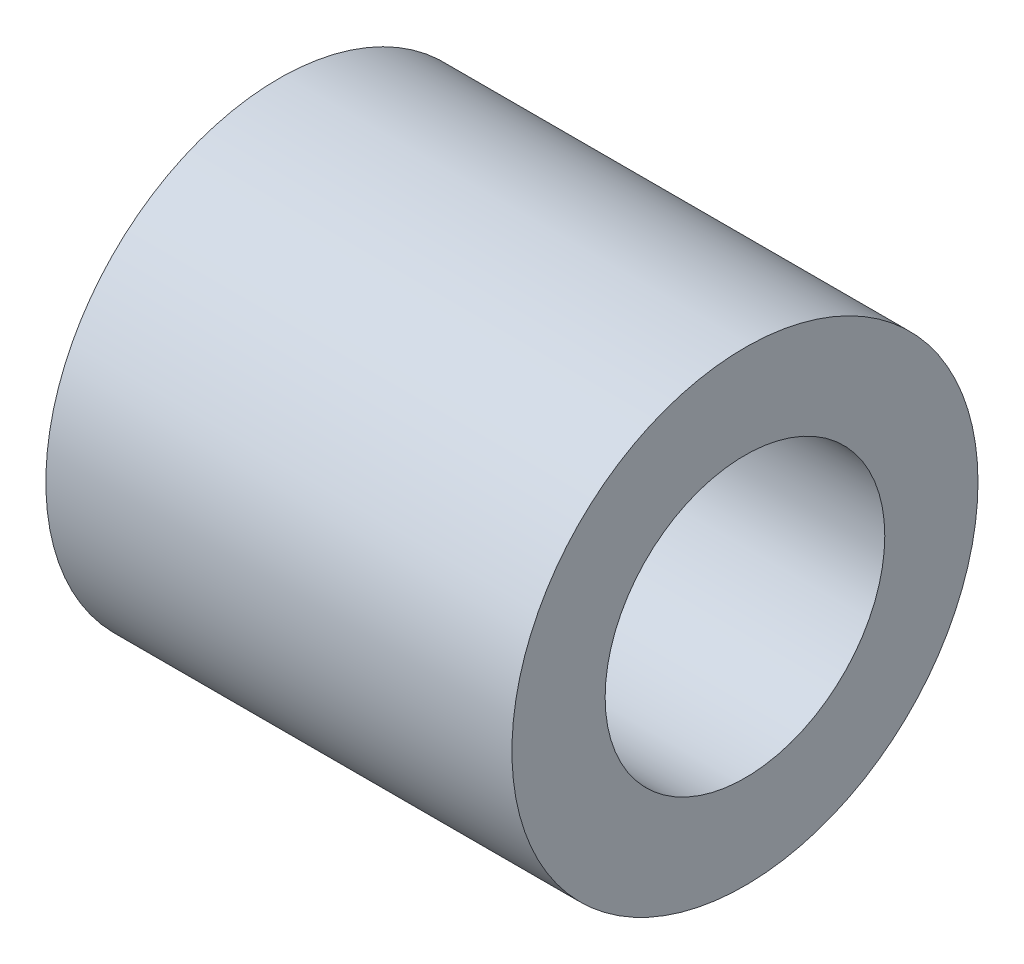
ISO-10303-21;
HEADER;
FILE_DESCRIPTION(('STEP AP214'),'2;1');
FILE_NAME('part.step','',(''),(''),'','','');
FILE_SCHEMA(('AUTOMOTIVE_DESIGN { 1 0 10303 214 1 1 1 1 }'));
ENDSEC;
DATA;
#1=APPLICATION_CONTEXT('core data for automotive mechanical design processes');
#2=APPLICATION_PROTOCOL_DEFINITION('international standard','automotive_design',2000,#1);
#3=PRODUCT_CONTEXT('',#1,'mechanical');
#4=PRODUCT('Part','Part','',(#3));
#5=PRODUCT_RELATED_PRODUCT_CATEGORY('part','',(#4));
#6=PRODUCT_DEFINITION_FORMATION('','',#4);
#7=PRODUCT_DEFINITION_CONTEXT('part definition',#1,'design');
#8=PRODUCT_DEFINITION('design','',#6,#7);
#9=PRODUCT_DEFINITION_SHAPE('','',#8);
#10=(LENGTH_UNIT() NAMED_UNIT(*) SI_UNIT(.MILLI.,.METRE.));
#11=(NAMED_UNIT(*) PLANE_ANGLE_UNIT() SI_UNIT($,.RADIAN.));
#12=(NAMED_UNIT(*) SI_UNIT($,.STERADIAN.) SOLID_ANGLE_UNIT());
#13=UNCERTAINTY_MEASURE_WITH_UNIT(LENGTH_MEASURE(1.E-05),#10,'distance_accuracy_value','');
#14=(GEOMETRIC_REPRESENTATION_CONTEXT(3) GLOBAL_UNCERTAINTY_ASSIGNED_CONTEXT((#13)) GLOBAL_UNIT_ASSIGNED_CONTEXT((#10,
#11,#12)) REPRESENTATION_CONTEXT('',''));
#15=CARTESIAN_POINT('',(0.,0.,0.));
#16=DIRECTION('',(0.,0.,1.));
#17=DIRECTION('',(1.,0.,0.));
#18=AXIS2_PLACEMENT_3D('',#15,#16,#17);
#19=CARTESIAN_POINT('',(2.5,0.,0.));
#20=DIRECTION('',(1.,0.,0.));
#21=DIRECTION('',(0.,0.,-1.));
#22=AXIS2_PLACEMENT_3D('',#19,#20,#21);
#23=PLANE('',#22);
#24=CARTESIAN_POINT('',(2.5,0.,0.));
#25=DIRECTION('',(1.,0.,0.));
#26=DIRECTION('',(0.,0.,-1.));
#27=AXIS2_PLACEMENT_3D('',#24,#25,#26);
#28=CIRCLE('',#27,2.5);
#29=CARTESIAN_POINT('',(2.5,0.,-2.5));
#30=VERTEX_POINT('',#29);
#31=EDGE_CURVE('E10',#30,#30,#28,.T.);
#32=ORIENTED_EDGE('',*,*,#31,.T.);
#33=EDGE_LOOP('',(#32));
#34=FACE_BOUND('',#33,.T.);
#35=CARTESIAN_POINT('',(2.5,0.,0.));
#36=DIRECTION('',(1.,0.,0.));
#37=DIRECTION('',(0.,0.,-1.));
#38=AXIS2_PLACEMENT_3D('',#35,#36,#37);
#39=CIRCLE('',#38,1.5);
#40=CARTESIAN_POINT('',(2.5,0.,-1.5));
#41=VERTEX_POINT('',#40);
#42=EDGE_CURVE('E50',#41,#41,#39,.T.);
#43=ORIENTED_EDGE('',*,*,#42,.F.);
#44=EDGE_LOOP('',(#43));
#45=FACE_BOUND('',#44,.T.);
#46=ADVANCED_FACE('F39',(#34,#45),#23,.T.);
#47=CARTESIAN_POINT('',(-2.5,0.,0.));
#48=DIRECTION('',(1.,0.,0.));
#49=DIRECTION('',(0.,0.,-1.));
#50=AXIS2_PLACEMENT_3D('',#47,#48,#49);
#51=PLANE('',#50);
#52=CARTESIAN_POINT('',(-2.5,0.,0.));
#53=DIRECTION('',(1.,0.,0.));
#54=DIRECTION('',(0.,0.,-1.));
#55=AXIS2_PLACEMENT_3D('',#52,#53,#54);
#56=CIRCLE('',#55,2.5);
#57=CARTESIAN_POINT('',(-2.5,0.,-2.5));
#58=VERTEX_POINT('',#57);
#59=EDGE_CURVE('E43',#58,#58,#56,.T.);
#60=ORIENTED_EDGE('',*,*,#59,.F.);
#61=EDGE_LOOP('',(#60));
#62=FACE_BOUND('',#61,.T.);
#63=CARTESIAN_POINT('',(-2.5,0.,0.));
#64=DIRECTION('',(1.,0.,0.));
#65=DIRECTION('',(0.,0.,-1.));
#66=AXIS2_PLACEMENT_3D('',#63,#64,#65);
#67=CIRCLE('',#66,1.5);
#68=CARTESIAN_POINT('',(-2.5,0.,-1.5));
#69=VERTEX_POINT('',#68);
#70=EDGE_CURVE('E52',#69,#69,#67,.T.);
#71=ORIENTED_EDGE('',*,*,#70,.T.);
#72=EDGE_LOOP('',(#71));
#73=FACE_BOUND('',#72,.T.);
#74=ADVANCED_FACE('F62',(#62,#73),#51,.F.);
#75=CARTESIAN_POINT('',(2.5,0.,0.));
#76=DIRECTION('',(-1.,0.,0.));
#77=DIRECTION('',(0.,0.,1.));
#78=AXIS2_PLACEMENT_3D('',#75,#76,#77);
#79=CYLINDRICAL_SURFACE('',#78,2.5);
#80=ORIENTED_EDGE('',*,*,#31,.F.);
#81=EDGE_LOOP('',(#80));
#82=FACE_BOUND('',#81,.T.);
#83=ORIENTED_EDGE('',*,*,#59,.T.);
#84=EDGE_LOOP('',(#83));
#85=FACE_BOUND('',#84,.T.);
#86=ADVANCED_FACE('F41',(#82,#85),#79,.T.);
#87=CARTESIAN_POINT('',(2.5,0.,0.));
#88=DIRECTION('',(-1.,0.,0.));
#89=DIRECTION('',(0.,0.,1.));
#90=AXIS2_PLACEMENT_3D('',#87,#88,#89);
#91=CYLINDRICAL_SURFACE('',#90,1.5);
#92=ORIENTED_EDGE('',*,*,#42,.T.);
#93=EDGE_LOOP('',(#92));
#94=FACE_BOUND('',#93,.T.);
#95=ORIENTED_EDGE('',*,*,#70,.F.);
#96=EDGE_LOOP('',(#95));
#97=FACE_BOUND('',#96,.T.);
#98=ADVANCED_FACE('F58',(#94,#97),#91,.F.);
#99=CLOSED_SHELL('',(#46,#74,#86,#98));
#100=MANIFOLD_SOLID_BREP('B2',#99);
#101=ADVANCED_BREP_SHAPE_REPRESENTATION('',(#18,#100),#14);
#102=SHAPE_DEFINITION_REPRESENTATION(#9,#101);
ENDSEC;
END-ISO-10303-21;
